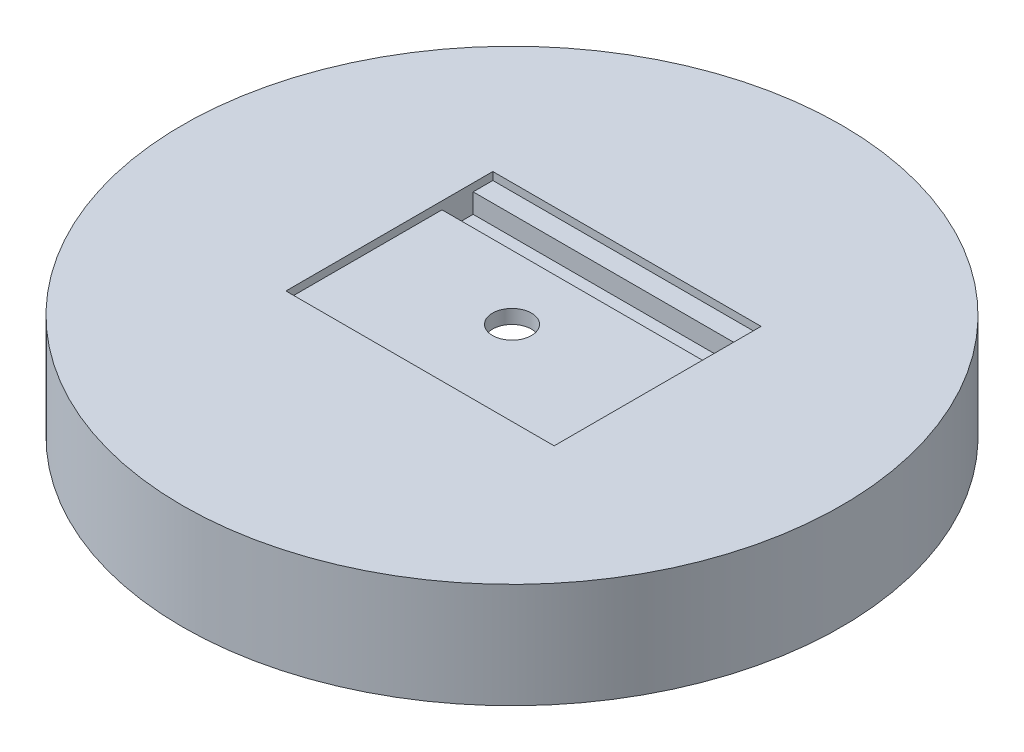
ISO-10303-21;
HEADER;
FILE_DESCRIPTION(('STEP AP214'),'2;1');
FILE_NAME('part.step','',(''),(''),'','','');
FILE_SCHEMA(('AUTOMOTIVE_DESIGN { 1 0 10303 214 1 1 1 1 }'));
ENDSEC;
DATA;
#1=APPLICATION_CONTEXT('core data for automotive mechanical design processes');
#2=APPLICATION_PROTOCOL_DEFINITION('international standard','automotive_design',2000,#1);
#3=PRODUCT_CONTEXT('',#1,'mechanical');
#4=PRODUCT('Part','Part','',(#3));
#5=PRODUCT_RELATED_PRODUCT_CATEGORY('part','',(#4));
#6=PRODUCT_DEFINITION_FORMATION('','',#4);
#7=PRODUCT_DEFINITION_CONTEXT('part definition',#1,'design');
#8=PRODUCT_DEFINITION('design','',#6,#7);
#9=PRODUCT_DEFINITION_SHAPE('','',#8);
#10=(LENGTH_UNIT() NAMED_UNIT(*) SI_UNIT(.MILLI.,.METRE.));
#11=(NAMED_UNIT(*) PLANE_ANGLE_UNIT() SI_UNIT($,.RADIAN.));
#12=(NAMED_UNIT(*) SI_UNIT($,.STERADIAN.) SOLID_ANGLE_UNIT());
#13=UNCERTAINTY_MEASURE_WITH_UNIT(LENGTH_MEASURE(1.E-05),#10,'distance_accuracy_value','');
#14=(GEOMETRIC_REPRESENTATION_CONTEXT(3) GLOBAL_UNCERTAINTY_ASSIGNED_CONTEXT((#13)) GLOBAL_UNIT_ASSIGNED_CONTEXT((#10,
#11,#12)) REPRESENTATION_CONTEXT('',''));
#15=CARTESIAN_POINT('',(0.,0.,0.));
#16=DIRECTION('',(0.,0.,1.));
#17=DIRECTION('',(1.,0.,0.));
#18=AXIS2_PLACEMENT_3D('',#15,#16,#17);
#19=CARTESIAN_POINT('',(0.,6.35,0.));
#20=DIRECTION('',(0.,1.,0.));
#21=DIRECTION('',(0.,0.,1.));
#22=AXIS2_PLACEMENT_3D('',#19,#20,#21);
#23=PLANE('',#22);
#24=DIRECTION('',(-1.,0.,0.));
#25=VECTOR('',#24,1.);
#26=CARTESIAN_POINT('',(0.,6.35,-6.21599999999999));
#27=LINE('',#26,#25);
#28=CARTESIAN_POINT('',(8.75,6.35,-6.21599999999999));
#29=VERTEX_POINT('',#28);
#30=CARTESIAN_POINT('',(-8.75,6.35,-6.21599999999999));
#31=VERTEX_POINT('',#30);
#32=EDGE_CURVE('E133',#29,#31,#27,.T.);
#33=ORIENTED_EDGE('',*,*,#32,.F.);
#34=DIRECTION('',(0.,0.,-1.));
#35=VECTOR('',#34,1.);
#36=CARTESIAN_POINT('',(8.75,6.35,6.));
#37=LINE('',#36,#35);
#38=CARTESIAN_POINT('',(8.75,6.35,-7.5));
#39=VERTEX_POINT('',#38);
#40=EDGE_CURVE('E135',#29,#39,#37,.T.);
#41=ORIENTED_EDGE('',*,*,#40,.T.);
#42=DIRECTION('',(-1.,0.,0.));
#43=VECTOR('',#42,1.);
#44=CARTESIAN_POINT('',(8.75,6.35,-7.5));
#45=LINE('',#44,#43);
#46=CARTESIAN_POINT('',(-8.75,6.35,-7.5));
#47=VERTEX_POINT('',#46);
#48=EDGE_CURVE('E139',#39,#47,#45,.T.);
#49=ORIENTED_EDGE('',*,*,#48,.T.);
#50=DIRECTION('',(0.,0.,1.));
#51=VECTOR('',#50,1.);
#52=CARTESIAN_POINT('',(-8.75,6.35,-7.5));
#53=LINE('',#52,#51);
#54=EDGE_CURVE('E142',#47,#31,#53,.T.);
#55=ORIENTED_EDGE('',*,*,#54,.T.);
#56=EDGE_LOOP('',(#33,#41,#49,#55));
#57=FACE_BOUND('',#56,.T.);
#58=ADVANCED_FACE('F34',(#57),#23,.T.);
#59=CARTESIAN_POINT('',(0.,0.,0.));
#60=DIRECTION('',(0.,1.,0.));
#61=DIRECTION('',(0.,0.,1.));
#62=AXIS2_PLACEMENT_3D('',#59,#60,#61);
#63=CYLINDRICAL_SURFACE('',#62,1.27);
#64=CARTESIAN_POINT('',(0.,5.44285714285714,0.));
#65=DIRECTION('',(0.,1.,0.));
#66=DIRECTION('',(0.,0.,1.));
#67=AXIS2_PLACEMENT_3D('',#64,#65,#66);
#68=CIRCLE('',#67,1.27);
#69=CARTESIAN_POINT('',(0.,5.44285714285714,1.27));
#70=VERTEX_POINT('',#69);
#71=EDGE_CURVE('E164',#70,#70,#68,.T.);
#72=ORIENTED_EDGE('',*,*,#71,.F.);
#73=EDGE_LOOP('',(#72));
#74=FACE_BOUND('',#73,.T.);
#75=CARTESIAN_POINT('',(0.,6.35,0.));
#76=DIRECTION('',(0.,1.,0.));
#77=DIRECTION('',(0.,0.,1.));
#78=AXIS2_PLACEMENT_3D('',#75,#76,#77);
#79=CIRCLE('',#78,1.27);
#80=CARTESIAN_POINT('',(0.,6.35,1.27));
#81=VERTEX_POINT('',#80);
#82=EDGE_CURVE('E38',#81,#81,#79,.F.);
#83=ORIENTED_EDGE('',*,*,#82,.F.);
#84=EDGE_LOOP('',(#83));
#85=FACE_BOUND('',#84,.T.);
#86=ADVANCED_FACE('F206',(#74,#85),#63,.F.);
#87=CARTESIAN_POINT('',(17.5,0.,0.));
#88=DIRECTION('',(0.,1.,0.));
#89=DIRECTION('',(0.,0.,1.));
#90=AXIS2_PLACEMENT_3D('',#87,#88,#89);
#91=PLANE('',#90);
#92=CARTESIAN_POINT('',(0.,0.,0.));
#93=DIRECTION('',(0.,1.,0.));
#94=DIRECTION('',(0.,0.,1.));
#95=AXIS2_PLACEMENT_3D('',#92,#93,#94);
#96=CIRCLE('',#95,21.5);
#97=CARTESIAN_POINT('',(0.,0.,21.5));
#98=VERTEX_POINT('',#97);
#99=EDGE_CURVE('E158',#98,#98,#96,.T.);
#100=ORIENTED_EDGE('',*,*,#99,.F.);
#101=EDGE_LOOP('',(#100));
#102=FACE_BOUND('',#101,.T.);
#103=CARTESIAN_POINT('',(0.,0.,0.));
#104=DIRECTION('',(0.,1.,0.));
#105=DIRECTION('',(0.,0.,1.));
#106=AXIS2_PLACEMENT_3D('',#103,#104,#105);
#107=CIRCLE('',#106,17.5);
#108=CARTESIAN_POINT('',(0.,0.,17.5));
#109=VERTEX_POINT('',#108);
#110=EDGE_CURVE('E167',#109,#109,#107,.T.);
#111=ORIENTED_EDGE('',*,*,#110,.T.);
#112=EDGE_LOOP('',(#111));
#113=FACE_BOUND('',#112,.T.);
#114=ADVANCED_FACE('F36',(#102,#113),#91,.F.);
#115=CARTESIAN_POINT('',(0.,5.44285714285714,0.));
#116=DIRECTION('',(0.,-1.,0.));
#117=DIRECTION('',(0.,0.,-1.));
#118=AXIS2_PLACEMENT_3D('',#115,#116,#117);
#119=CONICAL_SURFACE('',#118,1.27,1.24722485761879);
#120=ORIENTED_EDGE('',*,*,#110,.F.);
#121=EDGE_LOOP('',(#120));
#122=FACE_BOUND('',#121,.T.);
#123=ORIENTED_EDGE('',*,*,#71,.T.);
#124=EDGE_LOOP('',(#123));
#125=FACE_BOUND('',#124,.T.);
#126=ADVANCED_FACE('F226',(#122,#125),#119,.F.);
#127=CARTESIAN_POINT('',(21.5,6.858,0.));
#128=DIRECTION('',(0.,-1.,0.));
#129=DIRECTION('',(0.,0.,-1.));
#130=AXIS2_PLACEMENT_3D('',#127,#128,#129);
#131=PLANE('',#130);
#132=DIRECTION('',(1.,0.,0.));
#133=VECTOR('',#132,1.);
#134=CARTESIAN_POINT('',(21.5,6.858,-7.5));
#135=LINE('',#134,#133);
#136=CARTESIAN_POINT('',(-8.75,6.858,-7.5));
#137=VERTEX_POINT('',#136);
#138=CARTESIAN_POINT('',(8.75,6.858,-7.5));
#139=VERTEX_POINT('',#138);
#140=EDGE_CURVE('E170',#137,#139,#135,.T.);
#141=ORIENTED_EDGE('',*,*,#140,.T.);
#142=DIRECTION('',(0.,0.,1.));
#143=VECTOR('',#142,1.);
#144=CARTESIAN_POINT('',(8.75,6.858,0.));
#145=LINE('',#144,#143);
#146=CARTESIAN_POINT('',(8.75,6.858,6.));
#147=VERTEX_POINT('',#146);
#148=EDGE_CURVE('E11',#139,#147,#145,.T.);
#149=ORIENTED_EDGE('',*,*,#148,.T.);
#150=DIRECTION('',(-1.,0.,0.));
#151=VECTOR('',#150,1.);
#152=CARTESIAN_POINT('',(21.5,6.858,6.));
#153=LINE('',#152,#151);
#154=CARTESIAN_POINT('',(-8.75,6.858,6.));
#155=VERTEX_POINT('',#154);
#156=EDGE_CURVE('E43',#147,#155,#153,.T.);
#157=ORIENTED_EDGE('',*,*,#156,.T.);
#158=DIRECTION('',(0.,0.,-1.));
#159=VECTOR('',#158,1.);
#160=CARTESIAN_POINT('',(-8.75,6.858,0.));
#161=LINE('',#160,#159);
#162=EDGE_CURVE('E173',#155,#137,#161,.T.);
#163=ORIENTED_EDGE('',*,*,#162,.T.);
#164=EDGE_LOOP('',(#141,#149,#157,#163));
#165=FACE_BOUND('',#164,.T.);
#166=CARTESIAN_POINT('',(0.,6.858,0.));
#167=DIRECTION('',(0.,1.,0.));
#168=DIRECTION('',(0.,0.,1.));
#169=AXIS2_PLACEMENT_3D('',#166,#167,#168);
#170=CIRCLE('',#169,21.5);
#171=CARTESIAN_POINT('',(0.,6.858,21.5));
#172=VERTEX_POINT('',#171);
#173=EDGE_CURVE('E161',#172,#172,#170,.T.);
#174=ORIENTED_EDGE('',*,*,#173,.T.);
#175=EDGE_LOOP('',(#174));
#176=FACE_BOUND('',#175,.T.);
#177=ADVANCED_FACE('F178',(#165,#176),#131,.F.);
#178=CARTESIAN_POINT('',(0.,0.,0.));
#179=DIRECTION('',(0.,1.,0.));
#180=DIRECTION('',(0.,0.,1.));
#181=AXIS2_PLACEMENT_3D('',#178,#179,#180);
#182=CYLINDRICAL_SURFACE('',#181,21.5);
#183=ORIENTED_EDGE('',*,*,#173,.F.);
#184=EDGE_LOOP('',(#183));
#185=FACE_BOUND('',#184,.T.);
#186=ORIENTED_EDGE('',*,*,#99,.T.);
#187=EDGE_LOOP('',(#186));
#188=FACE_BOUND('',#187,.T.);
#189=ADVANCED_FACE('F215',(#185,#188),#182,.T.);
#190=DIRECTION('',(1.,0.,0.));
#191=VECTOR('',#190,1.);
#192=CARTESIAN_POINT('',(0.,6.35,-4.18399999999999));
#193=LINE('',#192,#191);
#194=CARTESIAN_POINT('',(-8.75,6.35,-4.18399999999999));
#195=VERTEX_POINT('',#194);
#196=CARTESIAN_POINT('',(8.75,6.35,-4.184));
#197=VERTEX_POINT('',#196);
#198=EDGE_CURVE('E128',#195,#197,#193,.T.);
#199=ORIENTED_EDGE('',*,*,#198,.F.);
#200=CARTESIAN_POINT('',(-8.75,6.35,6.));
#201=VERTEX_POINT('',#200);
#202=EDGE_CURVE('E107',#195,#201,#53,.T.);
#203=ORIENTED_EDGE('',*,*,#202,.T.);
#204=DIRECTION('',(1.,0.,0.));
#205=VECTOR('',#204,1.);
#206=CARTESIAN_POINT('',(-8.75,6.35,6.));
#207=LINE('',#206,#205);
#208=CARTESIAN_POINT('',(8.75,6.35,6.));
#209=VERTEX_POINT('',#208);
#210=EDGE_CURVE('E145',#201,#209,#207,.T.);
#211=ORIENTED_EDGE('',*,*,#210,.T.);
#212=EDGE_CURVE('E136',#209,#197,#37,.T.);
#213=ORIENTED_EDGE('',*,*,#212,.T.);
#214=EDGE_LOOP('',(#199,#203,#211,#213));
#215=FACE_BOUND('',#214,.T.);
#216=ORIENTED_EDGE('',*,*,#82,.T.);
#217=EDGE_LOOP('',(#216));
#218=FACE_BOUND('',#217,.T.);
#219=ADVANCED_FACE('F187',(#215,#218),#23,.T.);
#220=CARTESIAN_POINT('',(8.75,6.35,6.));
#221=DIRECTION('',(1.,0.,0.));
#222=DIRECTION('',(0.,0.,-1.));
#223=AXIS2_PLACEMENT_3D('',#220,#221,#222);
#224=PLANE('',#223);
#225=DIRECTION('',(0.,1.,0.));
#226=VECTOR('',#225,1.);
#227=CARTESIAN_POINT('',(8.75,6.35,6.));
#228=LINE('',#227,#226);
#229=EDGE_CURVE('E148',#209,#147,#228,.T.);
#230=ORIENTED_EDGE('',*,*,#229,.T.);
#231=ORIENTED_EDGE('',*,*,#148,.F.);
#232=DIRECTION('',(0.,1.,0.));
#233=VECTOR('',#232,1.);
#234=CARTESIAN_POINT('',(8.75,6.35,-7.5));
#235=LINE('',#234,#233);
#236=EDGE_CURVE('E58',#39,#139,#235,.T.);
#237=ORIENTED_EDGE('',*,*,#236,.F.);
#238=ORIENTED_EDGE('',*,*,#40,.F.);
#239=DIRECTION('',(0.,1.,0.));
#240=VECTOR('',#239,1.);
#241=CARTESIAN_POINT('',(8.75,5.08,-6.21599999999999));
#242=LINE('',#241,#240);
#243=CARTESIAN_POINT('',(8.75,5.08,-6.21599999999999));
#244=VERTEX_POINT('',#243);
#245=EDGE_CURVE('E129',#244,#29,#242,.T.);
#246=ORIENTED_EDGE('',*,*,#245,.F.);
#247=DIRECTION('',(0.,0.,-1.));
#248=VECTOR('',#247,1.);
#249=CARTESIAN_POINT('',(8.75,5.08,-6.21599999999999));
#250=LINE('',#249,#248);
#251=CARTESIAN_POINT('',(8.75,5.08,-4.184));
#252=VERTEX_POINT('',#251);
#253=EDGE_CURVE('E118',#252,#244,#250,.T.);
#254=ORIENTED_EDGE('',*,*,#253,.F.);
#255=DIRECTION('',(0.,1.,0.));
#256=VECTOR('',#255,1.);
#257=CARTESIAN_POINT('',(8.75,5.08,-4.184));
#258=LINE('',#257,#256);
#259=EDGE_CURVE('E108',#252,#197,#258,.T.);
#260=ORIENTED_EDGE('',*,*,#259,.T.);
#261=ORIENTED_EDGE('',*,*,#212,.F.);
#262=EDGE_LOOP('',(#230,#231,#237,#238,#246,#254,#260,#261));
#263=FACE_BOUND('',#262,.T.);
#264=ADVANCED_FACE('F185',(#263),#224,.F.);
#265=CARTESIAN_POINT('',(-8.75,6.35,6.));
#266=DIRECTION('',(0.,0.,1.));
#267=DIRECTION('',(1.,0.,0.));
#268=AXIS2_PLACEMENT_3D('',#265,#266,#267);
#269=PLANE('',#268);
#270=ORIENTED_EDGE('',*,*,#229,.F.);
#271=ORIENTED_EDGE('',*,*,#210,.F.);
#272=DIRECTION('',(0.,1.,0.));
#273=VECTOR('',#272,1.);
#274=CARTESIAN_POINT('',(-8.75,6.35,6.));
#275=LINE('',#274,#273);
#276=EDGE_CURVE('E151',#201,#155,#275,.T.);
#277=ORIENTED_EDGE('',*,*,#276,.T.);
#278=ORIENTED_EDGE('',*,*,#156,.F.);
#279=EDGE_LOOP('',(#270,#271,#277,#278));
#280=FACE_BOUND('',#279,.T.);
#281=ADVANCED_FACE('F181',(#280),#269,.F.);
#282=CARTESIAN_POINT('',(-8.75,6.35,-7.5));
#283=DIRECTION('',(-1.,0.,0.));
#284=DIRECTION('',(0.,0.,1.));
#285=AXIS2_PLACEMENT_3D('',#282,#283,#284);
#286=PLANE('',#285);
#287=ORIENTED_EDGE('',*,*,#202,.F.);
#288=DIRECTION('',(0.,1.,0.));
#289=VECTOR('',#288,1.);
#290=CARTESIAN_POINT('',(-8.75,5.08,-4.18399999999999));
#291=LINE('',#290,#289);
#292=CARTESIAN_POINT('',(-8.75,5.08,-4.18399999999999));
#293=VERTEX_POINT('',#292);
#294=EDGE_CURVE('E50',#293,#195,#291,.T.);
#295=ORIENTED_EDGE('',*,*,#294,.F.);
#296=DIRECTION('',(0.,0.,1.));
#297=VECTOR('',#296,1.);
#298=CARTESIAN_POINT('',(-8.75,5.08,-6.21599999999999));
#299=LINE('',#298,#297);
#300=CARTESIAN_POINT('',(-8.75,5.08,-6.21599999999999));
#301=VERTEX_POINT('',#300);
#302=EDGE_CURVE('E104',#301,#293,#299,.T.);
#303=ORIENTED_EDGE('',*,*,#302,.F.);
#304=DIRECTION('',(0.,1.,0.));
#305=VECTOR('',#304,1.);
#306=CARTESIAN_POINT('',(-8.75,5.08,-6.21599999999999));
#307=LINE('',#306,#305);
#308=EDGE_CURVE('E126',#301,#31,#307,.T.);
#309=ORIENTED_EDGE('',*,*,#308,.T.);
#310=ORIENTED_EDGE('',*,*,#54,.F.);
#311=DIRECTION('',(0.,1.,0.));
#312=VECTOR('',#311,1.);
#313=CARTESIAN_POINT('',(-8.75,6.35,-7.5));
#314=LINE('',#313,#312);
#315=EDGE_CURVE('E154',#47,#137,#314,.T.);
#316=ORIENTED_EDGE('',*,*,#315,.T.);
#317=ORIENTED_EDGE('',*,*,#162,.F.);
#318=ORIENTED_EDGE('',*,*,#276,.F.);
#319=EDGE_LOOP('',(#287,#295,#303,#309,#310,#316,#317,#318));
#320=FACE_BOUND('',#319,.T.);
#321=ADVANCED_FACE('F101',(#320),#286,.F.);
#322=CARTESIAN_POINT('',(8.75,6.35,-7.5));
#323=DIRECTION('',(0.,0.,-1.));
#324=DIRECTION('',(-1.,0.,0.));
#325=AXIS2_PLACEMENT_3D('',#322,#323,#324);
#326=PLANE('',#325);
#327=ORIENTED_EDGE('',*,*,#315,.F.);
#328=ORIENTED_EDGE('',*,*,#48,.F.);
#329=ORIENTED_EDGE('',*,*,#236,.T.);
#330=ORIENTED_EDGE('',*,*,#140,.F.);
#331=EDGE_LOOP('',(#327,#328,#329,#330));
#332=FACE_BOUND('',#331,.T.);
#333=ADVANCED_FACE('F190',(#332),#326,.F.);
#334=CARTESIAN_POINT('',(8.75,5.08,-6.21599999999999));
#335=DIRECTION('',(0.,0.,-1.));
#336=DIRECTION('',(-1.,0.,0.));
#337=AXIS2_PLACEMENT_3D('',#334,#335,#336);
#338=PLANE('',#337);
#339=ORIENTED_EDGE('',*,*,#32,.T.);
#340=ORIENTED_EDGE('',*,*,#308,.F.);
#341=DIRECTION('',(-1.,0.,0.));
#342=VECTOR('',#341,1.);
#343=CARTESIAN_POINT('',(8.75,5.08,-6.21599999999999));
#344=LINE('',#343,#342);
#345=EDGE_CURVE('E109',#244,#301,#344,.T.);
#346=ORIENTED_EDGE('',*,*,#345,.F.);
#347=ORIENTED_EDGE('',*,*,#245,.T.);
#348=EDGE_LOOP('',(#339,#340,#346,#347));
#349=FACE_BOUND('',#348,.T.);
#350=ADVANCED_FACE('F195',(#349),#338,.F.);
#351=CARTESIAN_POINT('',(8.75,5.08,-4.184));
#352=DIRECTION('',(0.,0.,1.));
#353=DIRECTION('',(1.,0.,0.));
#354=AXIS2_PLACEMENT_3D('',#351,#352,#353);
#355=PLANE('',#354);
#356=ORIENTED_EDGE('',*,*,#198,.T.);
#357=ORIENTED_EDGE('',*,*,#259,.F.);
#358=DIRECTION('',(1.,0.,0.));
#359=VECTOR('',#358,1.);
#360=CARTESIAN_POINT('',(8.75,5.08,-4.184));
#361=LINE('',#360,#359);
#362=EDGE_CURVE('E112',#293,#252,#361,.T.);
#363=ORIENTED_EDGE('',*,*,#362,.F.);
#364=ORIENTED_EDGE('',*,*,#294,.T.);
#365=EDGE_LOOP('',(#356,#357,#363,#364));
#366=FACE_BOUND('',#365,.T.);
#367=ADVANCED_FACE('F113',(#366),#355,.F.);
#368=CARTESIAN_POINT('',(0.,5.08,0.));
#369=DIRECTION('',(0.,-1.,0.));
#370=DIRECTION('',(0.,0.,-1.));
#371=AXIS2_PLACEMENT_3D('',#368,#369,#370);
#372=PLANE('',#371);
#373=ORIENTED_EDGE('',*,*,#302,.T.);
#374=ORIENTED_EDGE('',*,*,#362,.T.);
#375=ORIENTED_EDGE('',*,*,#253,.T.);
#376=ORIENTED_EDGE('',*,*,#345,.T.);
#377=EDGE_LOOP('',(#373,#374,#375,#376));
#378=FACE_BOUND('',#377,.T.);
#379=ADVANCED_FACE('F120',(#378),#372,.F.);
#380=CLOSED_SHELL('',(#58,#86,#114,#126,#177,#189,#219,#264,#281,#321,#333,#350,#367,#379));
#381=MANIFOLD_SOLID_BREP('B2',#380);
#382=ADVANCED_BREP_SHAPE_REPRESENTATION('',(#18,#381),#14);
#383=SHAPE_DEFINITION_REPRESENTATION(#9,#382);
ENDSEC;
END-ISO-10303-21;
